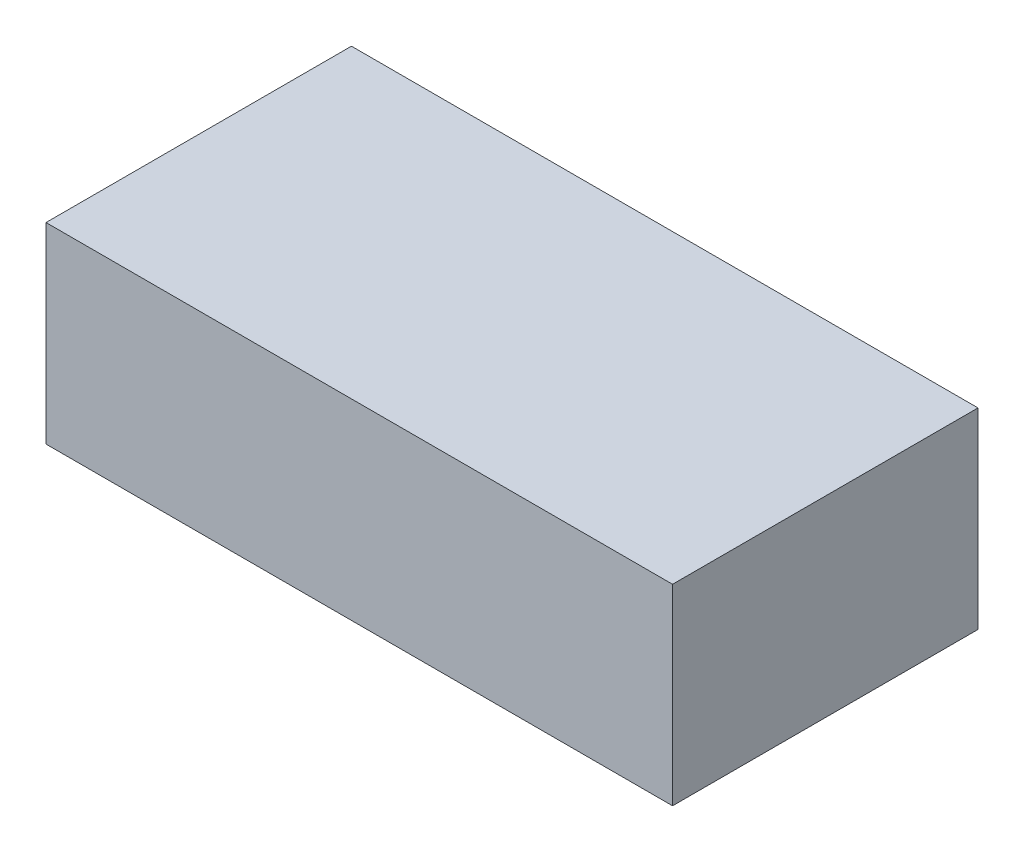
ISO-10303-21;
HEADER;
FILE_DESCRIPTION(('STEP AP214'),'2;1');
FILE_NAME('part.step','',(''),(''),'','','');
FILE_SCHEMA(('AUTOMOTIVE_DESIGN { 1 0 10303 214 1 1 1 1 }'));
ENDSEC;
DATA;
#1=APPLICATION_CONTEXT('core data for automotive mechanical design processes');
#2=APPLICATION_PROTOCOL_DEFINITION('international standard','automotive_design',2000,#1);
#3=PRODUCT_CONTEXT('',#1,'mechanical');
#4=PRODUCT('Part','Part','',(#3));
#5=PRODUCT_RELATED_PRODUCT_CATEGORY('part','',(#4));
#6=PRODUCT_DEFINITION_FORMATION('','',#4);
#7=PRODUCT_DEFINITION_CONTEXT('part definition',#1,'design');
#8=PRODUCT_DEFINITION('design','',#6,#7);
#9=PRODUCT_DEFINITION_SHAPE('','',#8);
#10=(LENGTH_UNIT() NAMED_UNIT(*) SI_UNIT(.MILLI.,.METRE.));
#11=(NAMED_UNIT(*) PLANE_ANGLE_UNIT() SI_UNIT($,.RADIAN.));
#12=(NAMED_UNIT(*) SI_UNIT($,.STERADIAN.) SOLID_ANGLE_UNIT());
#13=UNCERTAINTY_MEASURE_WITH_UNIT(LENGTH_MEASURE(1.E-05),#10,'distance_accuracy_value','');
#14=(GEOMETRIC_REPRESENTATION_CONTEXT(3) GLOBAL_UNCERTAINTY_ASSIGNED_CONTEXT((#13)) GLOBAL_UNIT_ASSIGNED_CONTEXT((#10,
#11,#12)) REPRESENTATION_CONTEXT('',''));
#15=CARTESIAN_POINT('',(0.,0.,0.));
#16=DIRECTION('',(0.,0.,1.));
#17=DIRECTION('',(1.,0.,0.));
#18=AXIS2_PLACEMENT_3D('',#15,#16,#17);
#19=CARTESIAN_POINT('',(40.,24.5,19.5));
#20=DIRECTION('',(-1.,0.,0.));
#21=DIRECTION('',(0.,0.,1.));
#22=AXIS2_PLACEMENT_3D('',#19,#20,#21);
#23=PLANE('',#22);
#24=DIRECTION('',(0.,0.,-1.));
#25=VECTOR('',#24,1.);
#26=CARTESIAN_POINT('',(40.,0.,19.5));
#27=LINE('',#26,#25);
#28=CARTESIAN_POINT('',(40.,0.,19.5));
#29=VERTEX_POINT('',#28);
#30=CARTESIAN_POINT('',(40.,0.,-19.5));
#31=VERTEX_POINT('',#30);
#32=EDGE_CURVE('E106',#29,#31,#27,.T.);
#33=ORIENTED_EDGE('',*,*,#32,.T.);
#34=DIRECTION('',(0.,-1.,0.));
#35=VECTOR('',#34,1.);
#36=CARTESIAN_POINT('',(40.,24.5,-19.5));
#37=LINE('',#36,#35);
#38=CARTESIAN_POINT('',(40.,24.5,-19.5));
#39=VERTEX_POINT('',#38);
#40=EDGE_CURVE('E11',#39,#31,#37,.T.);
#41=ORIENTED_EDGE('',*,*,#40,.F.);
#42=DIRECTION('',(0.,0.,-1.));
#43=VECTOR('',#42,1.);
#44=CARTESIAN_POINT('',(40.,24.5,19.5));
#45=LINE('',#44,#43);
#46=CARTESIAN_POINT('',(40.,24.5,19.5));
#47=VERTEX_POINT('',#46);
#48=EDGE_CURVE('E94',#47,#39,#45,.T.);
#49=ORIENTED_EDGE('',*,*,#48,.F.);
#50=DIRECTION('',(0.,-1.,0.));
#51=VECTOR('',#50,1.);
#52=CARTESIAN_POINT('',(40.,24.5,19.5));
#53=LINE('',#52,#51);
#54=EDGE_CURVE('E102',#47,#29,#53,.T.);
#55=ORIENTED_EDGE('',*,*,#54,.T.);
#56=EDGE_LOOP('',(#33,#41,#49,#55));
#57=FACE_BOUND('',#56,.T.);
#58=ADVANCED_FACE('F43',(#57),#23,.F.);
#59=CARTESIAN_POINT('',(-40.,24.5,-19.5));
#60=DIRECTION('',(0.,0.,1.));
#61=DIRECTION('',(1.,0.,0.));
#62=AXIS2_PLACEMENT_3D('',#59,#60,#61);
#63=PLANE('',#62);
#64=DIRECTION('',(-1.,0.,0.));
#65=VECTOR('',#64,1.);
#66=CARTESIAN_POINT('',(-40.,0.,-19.5));
#67=LINE('',#66,#65);
#68=CARTESIAN_POINT('',(-40.,0.,-19.5));
#69=VERTEX_POINT('',#68);
#70=EDGE_CURVE('E98',#31,#69,#67,.T.);
#71=ORIENTED_EDGE('',*,*,#70,.T.);
#72=DIRECTION('',(0.,-1.,0.));
#73=VECTOR('',#72,1.);
#74=CARTESIAN_POINT('',(-40.,24.5,-19.5));
#75=LINE('',#74,#73);
#76=CARTESIAN_POINT('',(-40.,24.5,-19.5));
#77=VERTEX_POINT('',#76);
#78=EDGE_CURVE('E51',#77,#69,#75,.T.);
#79=ORIENTED_EDGE('',*,*,#78,.F.);
#80=DIRECTION('',(-1.,0.,0.));
#81=VECTOR('',#80,1.);
#82=CARTESIAN_POINT('',(-40.,24.5,-19.5));
#83=LINE('',#82,#81);
#84=EDGE_CURVE('E89',#39,#77,#83,.T.);
#85=ORIENTED_EDGE('',*,*,#84,.F.);
#86=ORIENTED_EDGE('',*,*,#40,.T.);
#87=EDGE_LOOP('',(#71,#79,#85,#86));
#88=FACE_BOUND('',#87,.T.);
#89=ADVANCED_FACE('F97',(#88),#63,.F.);
#90=CARTESIAN_POINT('',(-40.,24.5,19.5));
#91=DIRECTION('',(1.,0.,0.));
#92=DIRECTION('',(0.,0.,-1.));
#93=AXIS2_PLACEMENT_3D('',#90,#91,#92);
#94=PLANE('',#93);
#95=DIRECTION('',(0.,0.,1.));
#96=VECTOR('',#95,1.);
#97=CARTESIAN_POINT('',(-40.,0.,19.5));
#98=LINE('',#97,#96);
#99=CARTESIAN_POINT('',(-40.,0.,19.5));
#100=VERTEX_POINT('',#99);
#101=EDGE_CURVE('E76',#69,#100,#98,.T.);
#102=ORIENTED_EDGE('',*,*,#101,.T.);
#103=DIRECTION('',(0.,-1.,0.));
#104=VECTOR('',#103,1.);
#105=CARTESIAN_POINT('',(-40.,24.5,19.5));
#106=LINE('',#105,#104);
#107=CARTESIAN_POINT('',(-40.,24.5,19.5));
#108=VERTEX_POINT('',#107);
#109=EDGE_CURVE('E99',#108,#100,#106,.T.);
#110=ORIENTED_EDGE('',*,*,#109,.F.);
#111=DIRECTION('',(0.,0.,1.));
#112=VECTOR('',#111,1.);
#113=CARTESIAN_POINT('',(-40.,24.5,19.5));
#114=LINE('',#113,#112);
#115=EDGE_CURVE('E92',#77,#108,#114,.T.);
#116=ORIENTED_EDGE('',*,*,#115,.F.);
#117=ORIENTED_EDGE('',*,*,#78,.T.);
#118=EDGE_LOOP('',(#102,#110,#116,#117));
#119=FACE_BOUND('',#118,.T.);
#120=ADVANCED_FACE('F100',(#119),#94,.F.);
#121=CARTESIAN_POINT('',(-40.,24.5,19.5));
#122=DIRECTION('',(0.,0.,-1.));
#123=DIRECTION('',(-1.,0.,0.));
#124=AXIS2_PLACEMENT_3D('',#121,#122,#123);
#125=PLANE('',#124);
#126=DIRECTION('',(1.,0.,0.));
#127=VECTOR('',#126,1.);
#128=CARTESIAN_POINT('',(-40.,0.,19.5));
#129=LINE('',#128,#127);
#130=EDGE_CURVE('E82',#100,#29,#129,.T.);
#131=ORIENTED_EDGE('',*,*,#130,.T.);
#132=ORIENTED_EDGE('',*,*,#54,.F.);
#133=DIRECTION('',(1.,0.,0.));
#134=VECTOR('',#133,1.);
#135=CARTESIAN_POINT('',(-40.,24.5,19.5));
#136=LINE('',#135,#134);
#137=EDGE_CURVE('E59',#108,#47,#136,.T.);
#138=ORIENTED_EDGE('',*,*,#137,.F.);
#139=ORIENTED_EDGE('',*,*,#109,.T.);
#140=EDGE_LOOP('',(#131,#132,#138,#139));
#141=FACE_BOUND('',#140,.T.);
#142=ADVANCED_FACE('F113',(#141),#125,.F.);
#143=CARTESIAN_POINT('',(0.,24.5,0.));
#144=DIRECTION('',(0.,-1.,0.));
#145=DIRECTION('',(0.,0.,-1.));
#146=AXIS2_PLACEMENT_3D('',#143,#144,#145);
#147=PLANE('',#146);
#148=ORIENTED_EDGE('',*,*,#48,.T.);
#149=ORIENTED_EDGE('',*,*,#84,.T.);
#150=ORIENTED_EDGE('',*,*,#115,.T.);
#151=ORIENTED_EDGE('',*,*,#137,.T.);
#152=EDGE_LOOP('',(#148,#149,#150,#151));
#153=FACE_BOUND('',#152,.T.);
#154=ADVANCED_FACE('F90',(#153),#147,.F.);
#155=CARTESIAN_POINT('',(0.,0.,0.));
#156=DIRECTION('',(0.,-1.,0.));
#157=DIRECTION('',(0.,0.,-1.));
#158=AXIS2_PLACEMENT_3D('',#155,#156,#157);
#159=PLANE('',#158);
#160=ORIENTED_EDGE('',*,*,#32,.F.);
#161=ORIENTED_EDGE('',*,*,#130,.F.);
#162=ORIENTED_EDGE('',*,*,#101,.F.);
#163=ORIENTED_EDGE('',*,*,#70,.F.);
#164=EDGE_LOOP('',(#160,#161,#162,#163));
#165=FACE_BOUND('',#164,.T.);
#166=ADVANCED_FACE('F116',(#165),#159,.T.);
#167=CLOSED_SHELL('',(#58,#89,#120,#142,#154,#166));
#168=MANIFOLD_SOLID_BREP('B2',#167);
#169=ADVANCED_BREP_SHAPE_REPRESENTATION('',(#18,#168),#14);
#170=SHAPE_DEFINITION_REPRESENTATION(#9,#169);
ENDSEC;
END-ISO-10303-21;
